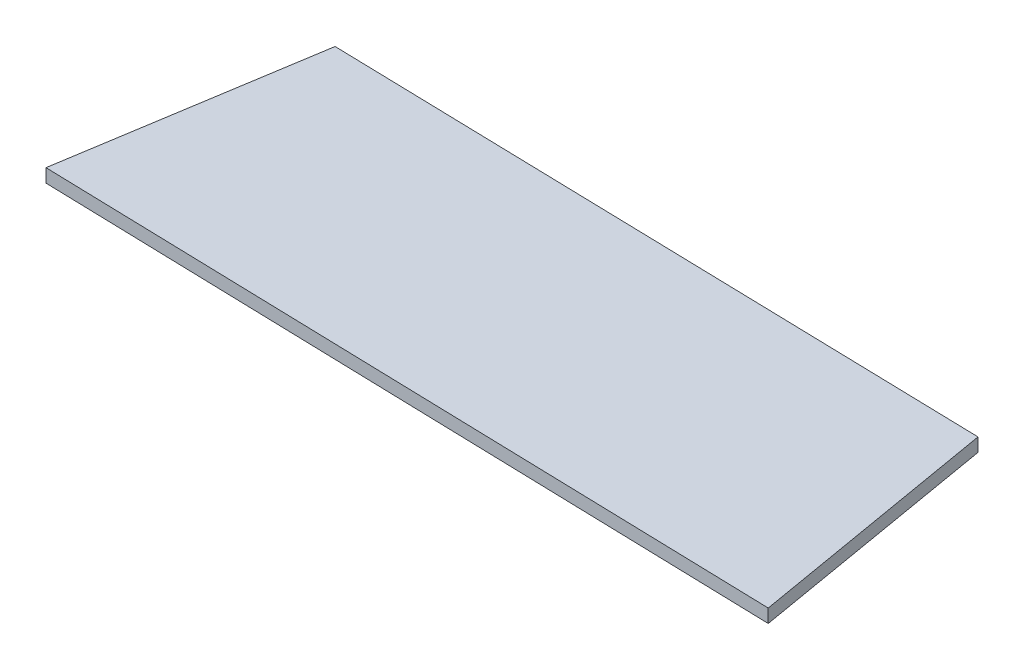
ISO-10303-21;
HEADER;
FILE_DESCRIPTION(('STEP AP214'),'2;1');
FILE_NAME('part.step','',(''),(''),'','','');
FILE_SCHEMA(('AUTOMOTIVE_DESIGN { 1 0 10303 214 1 1 1 1 }'));
ENDSEC;
DATA;
#1=APPLICATION_CONTEXT('core data for automotive mechanical design processes');
#2=APPLICATION_PROTOCOL_DEFINITION('international standard','automotive_design',2000,#1);
#3=PRODUCT_CONTEXT('',#1,'mechanical');
#4=PRODUCT('Part','Part','',(#3));
#5=PRODUCT_RELATED_PRODUCT_CATEGORY('part','',(#4));
#6=PRODUCT_DEFINITION_FORMATION('','',#4);
#7=PRODUCT_DEFINITION_CONTEXT('part definition',#1,'design');
#8=PRODUCT_DEFINITION('design','',#6,#7);
#9=PRODUCT_DEFINITION_SHAPE('','',#8);
#10=(LENGTH_UNIT() NAMED_UNIT(*) SI_UNIT(.MILLI.,.METRE.));
#11=(NAMED_UNIT(*) PLANE_ANGLE_UNIT() SI_UNIT($,.RADIAN.));
#12=(NAMED_UNIT(*) SI_UNIT($,.STERADIAN.) SOLID_ANGLE_UNIT());
#13=UNCERTAINTY_MEASURE_WITH_UNIT(LENGTH_MEASURE(1.E-05),#10,'distance_accuracy_value','');
#14=(GEOMETRIC_REPRESENTATION_CONTEXT(3) GLOBAL_UNCERTAINTY_ASSIGNED_CONTEXT((#13)) GLOBAL_UNIT_ASSIGNED_CONTEXT((#10,
#11,#12)) REPRESENTATION_CONTEXT('',''));
#15=CARTESIAN_POINT('',(0.,0.,0.));
#16=DIRECTION('',(0.,0.,1.));
#17=DIRECTION('',(1.,0.,0.));
#18=AXIS2_PLACEMENT_3D('',#15,#16,#17);
#19=CARTESIAN_POINT('',(104.260718726174,2.,-34.7154438202023));
#20=DIRECTION('',(-0.0252754547013616,0.,0.999680524662574));
#21=DIRECTION('',(0.999680524662574,0.,0.0252754547013616));
#22=AXIS2_PLACEMENT_3D('',#19,#20,#21);
#23=PLANE('',#22);
#24=DIRECTION('',(-0.999680524662574,0.,-0.0252754547013616));
#25=VECTOR('',#24,1.);
#26=CARTESIAN_POINT('',(104.260718726174,0.,-34.7154438202023));
#27=LINE('',#26,#25);
#28=CARTESIAN_POINT('',(104.260718726174,0.,-34.7154438202023));
#29=VERTEX_POINT('',#28);
#30=CARTESIAN_POINT('',(5.91025727711972,0.,-37.202090875823));
#31=VERTEX_POINT('',#30);
#32=EDGE_CURVE('E107',#29,#31,#27,.T.);
#33=ORIENTED_EDGE('',*,*,#32,.T.);
#34=DIRECTION('',(0.,-1.,0.));
#35=VECTOR('',#34,1.);
#36=CARTESIAN_POINT('',(5.91025727711972,2.,-37.202090875823));
#37=LINE('',#36,#35);
#38=CARTESIAN_POINT('',(5.91025727711972,2.,-37.202090875823));
#39=VERTEX_POINT('',#38);
#40=EDGE_CURVE('E11',#39,#31,#37,.T.);
#41=ORIENTED_EDGE('',*,*,#40,.F.);
#42=DIRECTION('',(-0.999680524662574,0.,-0.0252754547013616));
#43=VECTOR('',#42,1.);
#44=CARTESIAN_POINT('',(104.260718726174,2.,-34.7154438202023));
#45=LINE('',#44,#43);
#46=CARTESIAN_POINT('',(104.260718726174,2.,-34.7154438202023));
#47=VERTEX_POINT('',#46);
#48=EDGE_CURVE('E91',#47,#39,#45,.T.);
#49=ORIENTED_EDGE('',*,*,#48,.F.);
#50=DIRECTION('',(0.,-1.,0.));
#51=VECTOR('',#50,1.);
#52=CARTESIAN_POINT('',(104.260718726174,2.,-34.7154438202023));
#53=LINE('',#52,#51);
#54=EDGE_CURVE('E103',#47,#29,#53,.T.);
#55=ORIENTED_EDGE('',*,*,#54,.T.);
#56=EDGE_LOOP('',(#33,#41,#49,#55));
#57=FACE_BOUND('',#56,.T.);
#58=ADVANCED_FACE('F39',(#57),#23,.F.);
#59=CARTESIAN_POINT('',(5.91025727711972,2.,-37.202090875823));
#60=DIRECTION('',(0.987614295963218,0.,0.156901250501957));
#61=DIRECTION('',(0.156901250501957,0.,-0.987614295963218));
#62=AXIS2_PLACEMENT_3D('',#59,#60,#61);
#63=PLANE('',#62);
#64=DIRECTION('',(-0.156901250501957,0.,0.987614295963218));
#65=VECTOR('',#64,1.);
#66=CARTESIAN_POINT('',(5.91025727711972,0.,-37.202090875823));
#67=LINE('',#66,#65);
#68=CARTESIAN_POINT('',(0.,0.,0.));
#69=VERTEX_POINT('',#68);
#70=EDGE_CURVE('E96',#31,#69,#67,.T.);
#71=ORIENTED_EDGE('',*,*,#70,.T.);
#72=DIRECTION('',(0.,-1.,0.));
#73=VECTOR('',#72,1.);
#74=CARTESIAN_POINT('',(0.,2.,0.));
#75=LINE('',#74,#73);
#76=CARTESIAN_POINT('',(0.,2.,0.));
#77=VERTEX_POINT('',#76);
#78=EDGE_CURVE('E48',#77,#69,#75,.T.);
#79=ORIENTED_EDGE('',*,*,#78,.F.);
#80=DIRECTION('',(-0.156901250501957,0.,0.987614295963218));
#81=VECTOR('',#80,1.);
#82=CARTESIAN_POINT('',(5.91025727711972,2.,-37.202090875823));
#83=LINE('',#82,#81);
#84=EDGE_CURVE('E86',#39,#77,#83,.T.);
#85=ORIENTED_EDGE('',*,*,#84,.F.);
#86=ORIENTED_EDGE('',*,*,#40,.T.);
#87=EDGE_LOOP('',(#71,#79,#85,#86));
#88=FACE_BOUND('',#87,.T.);
#89=ADVANCED_FACE('F95',(#88),#63,.F.);
#90=CARTESIAN_POINT('',(0.,2.,0.));
#91=DIRECTION('',(0.0272732500128264,0.,-0.999628015730721));
#92=DIRECTION('',(-0.999628015730721,0.,-0.0272732500128264));
#93=AXIS2_PLACEMENT_3D('',#90,#91,#92);
#94=PLANE('',#93);
#95=DIRECTION('',(0.999628015730721,0.,0.0272732500128264));
#96=VECTOR('',#95,1.);
#97=CARTESIAN_POINT('',(0.,0.,0.));
#98=LINE('',#97,#96);
#99=CARTESIAN_POINT('',(110.717432038138,0.,3.02074787544537));
#100=VERTEX_POINT('',#99);
#101=EDGE_CURVE('E73',#69,#100,#98,.T.);
#102=ORIENTED_EDGE('',*,*,#101,.T.);
#103=DIRECTION('',(0.,-1.,0.));
#104=VECTOR('',#103,1.);
#105=CARTESIAN_POINT('',(110.717432038138,2.,3.02074787544537));
#106=LINE('',#105,#104);
#107=CARTESIAN_POINT('',(110.717432038138,2.,3.02074787544537));
#108=VERTEX_POINT('',#107);
#109=EDGE_CURVE('E98',#108,#100,#106,.T.);
#110=ORIENTED_EDGE('',*,*,#109,.F.);
#111=DIRECTION('',(0.999628015730721,0.,0.0272732500128264));
#112=VECTOR('',#111,1.);
#113=CARTESIAN_POINT('',(0.,2.,0.));
#114=LINE('',#113,#112);
#115=EDGE_CURVE('E89',#77,#108,#114,.T.);
#116=ORIENTED_EDGE('',*,*,#115,.F.);
#117=ORIENTED_EDGE('',*,*,#78,.T.);
#118=EDGE_LOOP('',(#102,#110,#116,#117));
#119=FACE_BOUND('',#118,.T.);
#120=ADVANCED_FACE('F99',(#119),#94,.F.);
#121=CARTESIAN_POINT('',(110.717432038138,2.,3.02074787544537));
#122=DIRECTION('',(-0.985675918229454,0.,0.16865047946129));
#123=DIRECTION('',(0.16865047946129,0.,0.985675918229454));
#124=AXIS2_PLACEMENT_3D('',#121,#122,#123);
#125=PLANE('',#124);
#126=DIRECTION('',(-0.16865047946129,0.,-0.985675918229454));
#127=VECTOR('',#126,1.);
#128=CARTESIAN_POINT('',(110.717432038138,0.,3.02074787544537));
#129=LINE('',#128,#127);
#130=EDGE_CURVE('E79',#100,#29,#129,.T.);
#131=ORIENTED_EDGE('',*,*,#130,.T.);
#132=ORIENTED_EDGE('',*,*,#54,.F.);
#133=DIRECTION('',(-0.16865047946129,0.,-0.985675918229454));
#134=VECTOR('',#133,1.);
#135=CARTESIAN_POINT('',(110.717432038138,2.,3.02074787544537));
#136=LINE('',#135,#134);
#137=EDGE_CURVE('E56',#108,#47,#136,.T.);
#138=ORIENTED_EDGE('',*,*,#137,.F.);
#139=ORIENTED_EDGE('',*,*,#109,.T.);
#140=EDGE_LOOP('',(#131,#132,#138,#139));
#141=FACE_BOUND('',#140,.T.);
#142=ADVANCED_FACE('F120',(#141),#125,.F.);
#143=CARTESIAN_POINT('',(0.,2.,0.));
#144=DIRECTION('',(0.,1.,0.));
#145=DIRECTION('',(0.,0.,1.));
#146=AXIS2_PLACEMENT_3D('',#143,#144,#145);
#147=PLANE('',#146);
#148=ORIENTED_EDGE('',*,*,#48,.T.);
#149=ORIENTED_EDGE('',*,*,#84,.T.);
#150=ORIENTED_EDGE('',*,*,#115,.T.);
#151=ORIENTED_EDGE('',*,*,#137,.T.);
#152=EDGE_LOOP('',(#148,#149,#150,#151));
#153=FACE_BOUND('',#152,.T.);
#154=ADVANCED_FACE('F87',(#153),#147,.T.);
#155=CARTESIAN_POINT('',(0.,0.,0.));
#156=DIRECTION('',(0.,1.,0.));
#157=DIRECTION('',(0.,0.,1.));
#158=AXIS2_PLACEMENT_3D('',#155,#156,#157);
#159=PLANE('',#158);
#160=ORIENTED_EDGE('',*,*,#32,.F.);
#161=ORIENTED_EDGE('',*,*,#130,.F.);
#162=ORIENTED_EDGE('',*,*,#101,.F.);
#163=ORIENTED_EDGE('',*,*,#70,.F.);
#164=EDGE_LOOP('',(#160,#161,#162,#163));
#165=FACE_BOUND('',#164,.T.);
#166=ADVANCED_FACE('F123',(#165),#159,.F.);
#167=CLOSED_SHELL('',(#58,#89,#120,#142,#154,#166));
#168=MANIFOLD_SOLID_BREP('B2',#167);
#169=ADVANCED_BREP_SHAPE_REPRESENTATION('',(#18,#168),#14);
#170=SHAPE_DEFINITION_REPRESENTATION(#9,#169);
ENDSEC;
END-ISO-10303-21;
